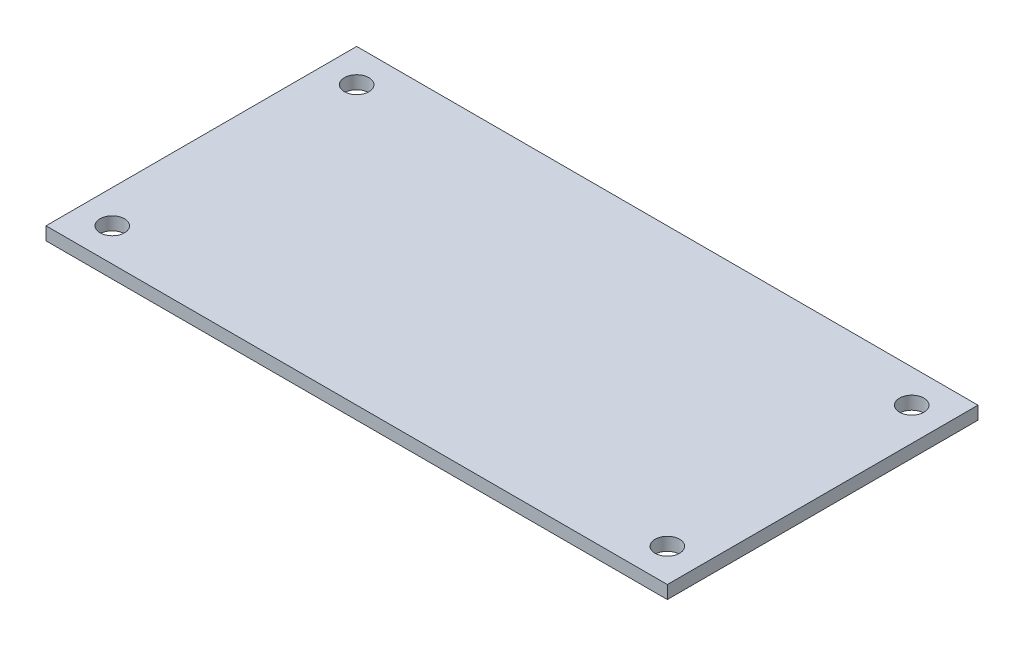
ISO-10303-21;
HEADER;
FILE_DESCRIPTION(('STEP AP214'),'2;1');
FILE_NAME('part.step','',(''),(''),'','','');
FILE_SCHEMA(('AUTOMOTIVE_DESIGN { 1 0 10303 214 1 1 1 1 }'));
ENDSEC;
DATA;
#1=APPLICATION_CONTEXT('core data for automotive mechanical design processes');
#2=APPLICATION_PROTOCOL_DEFINITION('international standard','automotive_design',2000,#1);
#3=PRODUCT_CONTEXT('',#1,'mechanical');
#4=PRODUCT('Part','Part','',(#3));
#5=PRODUCT_RELATED_PRODUCT_CATEGORY('part','',(#4));
#6=PRODUCT_DEFINITION_FORMATION('','',#4);
#7=PRODUCT_DEFINITION_CONTEXT('part definition',#1,'design');
#8=PRODUCT_DEFINITION('design','',#6,#7);
#9=PRODUCT_DEFINITION_SHAPE('','',#8);
#10=(LENGTH_UNIT() NAMED_UNIT(*) SI_UNIT(.MILLI.,.METRE.));
#11=(NAMED_UNIT(*) PLANE_ANGLE_UNIT() SI_UNIT($,.RADIAN.));
#12=(NAMED_UNIT(*) SI_UNIT($,.STERADIAN.) SOLID_ANGLE_UNIT());
#13=UNCERTAINTY_MEASURE_WITH_UNIT(LENGTH_MEASURE(1.E-05),#10,'distance_accuracy_value','');
#14=(GEOMETRIC_REPRESENTATION_CONTEXT(3) GLOBAL_UNCERTAINTY_ASSIGNED_CONTEXT((#13)) GLOBAL_UNIT_ASSIGNED_CONTEXT((#10,
#11,#12)) REPRESENTATION_CONTEXT('',''));
#15=CARTESIAN_POINT('',(0.,0.,0.));
#16=DIRECTION('',(0.,0.,1.));
#17=DIRECTION('',(1.,0.,0.));
#18=AXIS2_PLACEMENT_3D('',#15,#16,#17);
#19=CARTESIAN_POINT('',(0.,1.6,0.));
#20=DIRECTION('',(0.,1.,0.));
#21=DIRECTION('',(0.,0.,1.));
#22=AXIS2_PLACEMENT_3D('',#19,#20,#21);
#23=PLANE('',#22);
#24=CARTESIAN_POINT('',(34.036,1.6,-14.986));
#25=DIRECTION('',(0.,1.,0.));
#26=DIRECTION('',(0.,0.,1.));
#27=AXIS2_PLACEMENT_3D('',#24,#25,#26);
#28=CIRCLE('',#27,1.5);
#29=CARTESIAN_POINT('',(34.036,1.6,-13.486));
#30=VERTEX_POINT('',#29);
#31=EDGE_CURVE('E142',#30,#30,#28,.T.);
#32=ORIENTED_EDGE('',*,*,#31,.F.);
#33=EDGE_LOOP('',(#32));
#34=FACE_BOUND('',#33,.T.);
#35=CARTESIAN_POINT('',(-34.036,1.6,-14.986));
#36=DIRECTION('',(0.,1.,0.));
#37=DIRECTION('',(0.,0.,1.));
#38=AXIS2_PLACEMENT_3D('',#35,#36,#37);
#39=CIRCLE('',#38,1.5);
#40=CARTESIAN_POINT('',(-34.036,1.6,-13.486));
#41=VERTEX_POINT('',#40);
#42=EDGE_CURVE('E112',#41,#41,#39,.T.);
#43=ORIENTED_EDGE('',*,*,#42,.F.);
#44=EDGE_LOOP('',(#43));
#45=FACE_BOUND('',#44,.T.);
#46=DIRECTION('',(0.,0.,1.));
#47=VECTOR('',#46,1.);
#48=CARTESIAN_POINT('',(-38.1,1.6,19.05));
#49=LINE('',#48,#47);
#50=CARTESIAN_POINT('',(-38.1,1.6,-19.05));
#51=VERTEX_POINT('',#50);
#52=CARTESIAN_POINT('',(-38.1,1.6,19.05));
#53=VERTEX_POINT('',#52);
#54=EDGE_CURVE('E92',#51,#53,#49,.T.);
#55=ORIENTED_EDGE('',*,*,#54,.T.);
#56=DIRECTION('',(1.,0.,0.));
#57=VECTOR('',#56,1.);
#58=CARTESIAN_POINT('',(38.1,1.6,19.05));
#59=LINE('',#58,#57);
#60=CARTESIAN_POINT('',(38.1,1.6,19.05));
#61=VERTEX_POINT('',#60);
#62=EDGE_CURVE('E87',#53,#61,#59,.T.);
#63=ORIENTED_EDGE('',*,*,#62,.T.);
#64=DIRECTION('',(0.,0.,-1.));
#65=VECTOR('',#64,1.);
#66=CARTESIAN_POINT('',(38.1,1.6,19.05));
#67=LINE('',#66,#65);
#68=CARTESIAN_POINT('',(38.1,1.6,-19.05));
#69=VERTEX_POINT('',#68);
#70=EDGE_CURVE('E90',#61,#69,#67,.T.);
#71=ORIENTED_EDGE('',*,*,#70,.T.);
#72=DIRECTION('',(-1.,0.,0.));
#73=VECTOR('',#72,1.);
#74=CARTESIAN_POINT('',(38.1,1.6,-19.05));
#75=LINE('',#74,#73);
#76=EDGE_CURVE('E57',#69,#51,#75,.T.);
#77=ORIENTED_EDGE('',*,*,#76,.T.);
#78=EDGE_LOOP('',(#55,#63,#71,#77));
#79=FACE_BOUND('',#78,.T.);
#80=CARTESIAN_POINT('',(-34.036,1.6,14.986));
#81=DIRECTION('',(0.,1.,0.));
#82=DIRECTION('',(0.,0.,1.));
#83=AXIS2_PLACEMENT_3D('',#80,#81,#82);
#84=CIRCLE('',#83,1.5);
#85=CARTESIAN_POINT('',(-34.036,1.6,16.486));
#86=VERTEX_POINT('',#85);
#87=EDGE_CURVE('E134',#86,#86,#84,.T.);
#88=ORIENTED_EDGE('',*,*,#87,.F.);
#89=EDGE_LOOP('',(#88));
#90=FACE_BOUND('',#89,.T.);
#91=CARTESIAN_POINT('',(34.036,1.6,14.986));
#92=DIRECTION('',(0.,1.,0.));
#93=DIRECTION('',(0.,0.,1.));
#94=AXIS2_PLACEMENT_3D('',#91,#92,#93);
#95=CIRCLE('',#94,1.5);
#96=CARTESIAN_POINT('',(34.036,1.6,16.486));
#97=VERTEX_POINT('',#96);
#98=EDGE_CURVE('E150',#97,#97,#95,.T.);
#99=ORIENTED_EDGE('',*,*,#98,.F.);
#100=EDGE_LOOP('',(#99));
#101=FACE_BOUND('',#100,.T.);
#102=ADVANCED_FACE('F39',(#34,#45,#79,#90,#101),#23,.T.);
#103=CARTESIAN_POINT('',(0.,0.,0.));
#104=DIRECTION('',(0.,1.,0.));
#105=DIRECTION('',(0.,0.,1.));
#106=AXIS2_PLACEMENT_3D('',#103,#104,#105);
#107=PLANE('',#106);
#108=DIRECTION('',(0.,0.,1.));
#109=VECTOR('',#108,1.);
#110=CARTESIAN_POINT('',(-38.1,0.,19.05));
#111=LINE('',#110,#109);
#112=CARTESIAN_POINT('',(-38.1,0.,-19.05));
#113=VERTEX_POINT('',#112);
#114=CARTESIAN_POINT('',(-38.1,0.,19.05));
#115=VERTEX_POINT('',#114);
#116=EDGE_CURVE('E108',#113,#115,#111,.T.);
#117=ORIENTED_EDGE('',*,*,#116,.F.);
#118=DIRECTION('',(-1.,0.,0.));
#119=VECTOR('',#118,1.);
#120=CARTESIAN_POINT('',(38.1,0.,-19.05));
#121=LINE('',#120,#119);
#122=CARTESIAN_POINT('',(38.1,0.,-19.05));
#123=VERTEX_POINT('',#122);
#124=EDGE_CURVE('E80',#123,#113,#121,.T.);
#125=ORIENTED_EDGE('',*,*,#124,.F.);
#126=DIRECTION('',(0.,0.,-1.));
#127=VECTOR('',#126,1.);
#128=CARTESIAN_POINT('',(38.1,0.,19.05));
#129=LINE('',#128,#127);
#130=CARTESIAN_POINT('',(38.1,0.,19.05));
#131=VERTEX_POINT('',#130);
#132=EDGE_CURVE('E74',#131,#123,#129,.T.);
#133=ORIENTED_EDGE('',*,*,#132,.F.);
#134=DIRECTION('',(1.,0.,0.));
#135=VECTOR('',#134,1.);
#136=CARTESIAN_POINT('',(38.1,0.,19.05));
#137=LINE('',#136,#135);
#138=EDGE_CURVE('E97',#115,#131,#137,.T.);
#139=ORIENTED_EDGE('',*,*,#138,.F.);
#140=EDGE_LOOP('',(#117,#125,#133,#139));
#141=FACE_BOUND('',#140,.T.);
#142=CARTESIAN_POINT('',(-34.036,0.,-14.986));
#143=DIRECTION('',(0.,1.,0.));
#144=DIRECTION('',(0.,0.,1.));
#145=AXIS2_PLACEMENT_3D('',#142,#143,#144);
#146=CIRCLE('',#145,1.5);
#147=CARTESIAN_POINT('',(-34.036,0.,-13.486));
#148=VERTEX_POINT('',#147);
#149=EDGE_CURVE('E130',#148,#148,#146,.T.);
#150=ORIENTED_EDGE('',*,*,#149,.T.);
#151=EDGE_LOOP('',(#150));
#152=FACE_BOUND('',#151,.T.);
#153=CARTESIAN_POINT('',(-34.036,0.,14.986));
#154=DIRECTION('',(0.,1.,0.));
#155=DIRECTION('',(0.,0.,1.));
#156=AXIS2_PLACEMENT_3D('',#153,#154,#155);
#157=CIRCLE('',#156,1.5);
#158=CARTESIAN_POINT('',(-34.036,0.,16.486));
#159=VERTEX_POINT('',#158);
#160=EDGE_CURVE('E138',#159,#159,#157,.T.);
#161=ORIENTED_EDGE('',*,*,#160,.T.);
#162=EDGE_LOOP('',(#161));
#163=FACE_BOUND('',#162,.T.);
#164=CARTESIAN_POINT('',(34.036,0.,-14.986));
#165=DIRECTION('',(0.,1.,0.));
#166=DIRECTION('',(0.,0.,1.));
#167=AXIS2_PLACEMENT_3D('',#164,#165,#166);
#168=CIRCLE('',#167,1.5);
#169=CARTESIAN_POINT('',(34.036,0.,-13.486));
#170=VERTEX_POINT('',#169);
#171=EDGE_CURVE('E146',#170,#170,#168,.T.);
#172=ORIENTED_EDGE('',*,*,#171,.T.);
#173=EDGE_LOOP('',(#172));
#174=FACE_BOUND('',#173,.T.);
#175=CARTESIAN_POINT('',(34.036,0.,14.986));
#176=DIRECTION('',(0.,1.,0.));
#177=DIRECTION('',(0.,0.,1.));
#178=AXIS2_PLACEMENT_3D('',#175,#176,#177);
#179=CIRCLE('',#178,1.5);
#180=CARTESIAN_POINT('',(34.036,0.,16.486));
#181=VERTEX_POINT('',#180);
#182=EDGE_CURVE('E154',#181,#181,#179,.T.);
#183=ORIENTED_EDGE('',*,*,#182,.T.);
#184=EDGE_LOOP('',(#183));
#185=FACE_BOUND('',#184,.T.);
#186=ADVANCED_FACE('F125',(#141,#152,#163,#174,#185),#107,.F.);
#187=CARTESIAN_POINT('',(-38.1,1.6,19.05));
#188=DIRECTION('',(1.,0.,0.));
#189=DIRECTION('',(0.,0.,-1.));
#190=AXIS2_PLACEMENT_3D('',#187,#188,#189);
#191=PLANE('',#190);
#192=ORIENTED_EDGE('',*,*,#116,.T.);
#193=DIRECTION('',(0.,-1.,0.));
#194=VECTOR('',#193,1.);
#195=CARTESIAN_POINT('',(-38.1,1.6,19.05));
#196=LINE('',#195,#194);
#197=EDGE_CURVE('E11',#53,#115,#196,.T.);
#198=ORIENTED_EDGE('',*,*,#197,.F.);
#199=ORIENTED_EDGE('',*,*,#54,.F.);
#200=DIRECTION('',(0.,-1.,0.));
#201=VECTOR('',#200,1.);
#202=CARTESIAN_POINT('',(-38.1,1.6,-19.05));
#203=LINE('',#202,#201);
#204=EDGE_CURVE('E104',#51,#113,#203,.T.);
#205=ORIENTED_EDGE('',*,*,#204,.T.);
#206=EDGE_LOOP('',(#192,#198,#199,#205));
#207=FACE_BOUND('',#206,.T.);
#208=ADVANCED_FACE('F41',(#207),#191,.F.);
#209=CARTESIAN_POINT('',(38.1,1.6,19.05));
#210=DIRECTION('',(0.,0.,-1.));
#211=DIRECTION('',(-1.,0.,0.));
#212=AXIS2_PLACEMENT_3D('',#209,#210,#211);
#213=PLANE('',#212);
#214=ORIENTED_EDGE('',*,*,#138,.T.);
#215=DIRECTION('',(0.,-1.,0.));
#216=VECTOR('',#215,1.);
#217=CARTESIAN_POINT('',(38.1,1.6,19.05));
#218=LINE('',#217,#216);
#219=EDGE_CURVE('E49',#61,#131,#218,.T.);
#220=ORIENTED_EDGE('',*,*,#219,.F.);
#221=ORIENTED_EDGE('',*,*,#62,.F.);
#222=ORIENTED_EDGE('',*,*,#197,.T.);
#223=EDGE_LOOP('',(#214,#220,#221,#222));
#224=FACE_BOUND('',#223,.T.);
#225=ADVANCED_FACE('F96',(#224),#213,.F.);
#226=CARTESIAN_POINT('',(38.1,1.6,19.05));
#227=DIRECTION('',(-1.,0.,0.));
#228=DIRECTION('',(0.,0.,1.));
#229=AXIS2_PLACEMENT_3D('',#226,#227,#228);
#230=PLANE('',#229);
#231=ORIENTED_EDGE('',*,*,#132,.T.);
#232=DIRECTION('',(0.,-1.,0.));
#233=VECTOR('',#232,1.);
#234=CARTESIAN_POINT('',(38.1,1.6,-19.05));
#235=LINE('',#234,#233);
#236=EDGE_CURVE('E99',#69,#123,#235,.T.);
#237=ORIENTED_EDGE('',*,*,#236,.F.);
#238=ORIENTED_EDGE('',*,*,#70,.F.);
#239=ORIENTED_EDGE('',*,*,#219,.T.);
#240=EDGE_LOOP('',(#231,#237,#238,#239));
#241=FACE_BOUND('',#240,.T.);
#242=ADVANCED_FACE('F100',(#241),#230,.F.);
#243=CARTESIAN_POINT('',(38.1,1.6,-19.05));
#244=DIRECTION('',(0.,0.,1.));
#245=DIRECTION('',(1.,0.,0.));
#246=AXIS2_PLACEMENT_3D('',#243,#244,#245);
#247=PLANE('',#246);
#248=ORIENTED_EDGE('',*,*,#124,.T.);
#249=ORIENTED_EDGE('',*,*,#204,.F.);
#250=ORIENTED_EDGE('',*,*,#76,.F.);
#251=ORIENTED_EDGE('',*,*,#236,.T.);
#252=EDGE_LOOP('',(#248,#249,#250,#251));
#253=FACE_BOUND('',#252,.T.);
#254=ADVANCED_FACE('F122',(#253),#247,.F.);
#255=CARTESIAN_POINT('',(-34.036,1.6,-14.986));
#256=DIRECTION('',(0.,-1.,0.));
#257=DIRECTION('',(0.,0.,-1.));
#258=AXIS2_PLACEMENT_3D('',#255,#256,#257);
#259=CYLINDRICAL_SURFACE('',#258,1.5);
#260=ORIENTED_EDGE('',*,*,#42,.T.);
#261=EDGE_LOOP('',(#260));
#262=FACE_BOUND('',#261,.T.);
#263=ORIENTED_EDGE('',*,*,#149,.F.);
#264=EDGE_LOOP('',(#263));
#265=FACE_BOUND('',#264,.T.);
#266=ADVANCED_FACE('F175',(#262,#265),#259,.F.);
#267=CARTESIAN_POINT('',(-34.036,1.6,14.986));
#268=DIRECTION('',(0.,-1.,0.));
#269=DIRECTION('',(0.,0.,-1.));
#270=AXIS2_PLACEMENT_3D('',#267,#268,#269);
#271=CYLINDRICAL_SURFACE('',#270,1.5);
#272=ORIENTED_EDGE('',*,*,#87,.T.);
#273=EDGE_LOOP('',(#272));
#274=FACE_BOUND('',#273,.T.);
#275=ORIENTED_EDGE('',*,*,#160,.F.);
#276=EDGE_LOOP('',(#275));
#277=FACE_BOUND('',#276,.T.);
#278=ADVANCED_FACE('F221',(#274,#277),#271,.F.);
#279=CARTESIAN_POINT('',(34.036,1.6,-14.986));
#280=DIRECTION('',(0.,-1.,0.));
#281=DIRECTION('',(0.,0.,-1.));
#282=AXIS2_PLACEMENT_3D('',#279,#280,#281);
#283=CYLINDRICAL_SURFACE('',#282,1.5);
#284=ORIENTED_EDGE('',*,*,#31,.T.);
#285=EDGE_LOOP('',(#284));
#286=FACE_BOUND('',#285,.T.);
#287=ORIENTED_EDGE('',*,*,#171,.F.);
#288=EDGE_LOOP('',(#287));
#289=FACE_BOUND('',#288,.T.);
#290=ADVANCED_FACE('F229',(#286,#289),#283,.F.);
#291=CARTESIAN_POINT('',(34.036,1.6,14.986));
#292=DIRECTION('',(0.,-1.,0.));
#293=DIRECTION('',(0.,0.,-1.));
#294=AXIS2_PLACEMENT_3D('',#291,#292,#293);
#295=CYLINDRICAL_SURFACE('',#294,1.5);
#296=ORIENTED_EDGE('',*,*,#98,.T.);
#297=EDGE_LOOP('',(#296));
#298=FACE_BOUND('',#297,.T.);
#299=ORIENTED_EDGE('',*,*,#182,.F.);
#300=EDGE_LOOP('',(#299));
#301=FACE_BOUND('',#300,.T.);
#302=ADVANCED_FACE('F162',(#298,#301),#295,.F.);
#303=CLOSED_SHELL('',(#102,#186,#208,#225,#242,#254,#266,#278,#290,#302));
#304=MANIFOLD_SOLID_BREP('B2',#303);
#305=ADVANCED_BREP_SHAPE_REPRESENTATION('',(#18,#304),#14);
#306=SHAPE_DEFINITION_REPRESENTATION(#9,#305);
ENDSEC;
END-ISO-10303-21;
